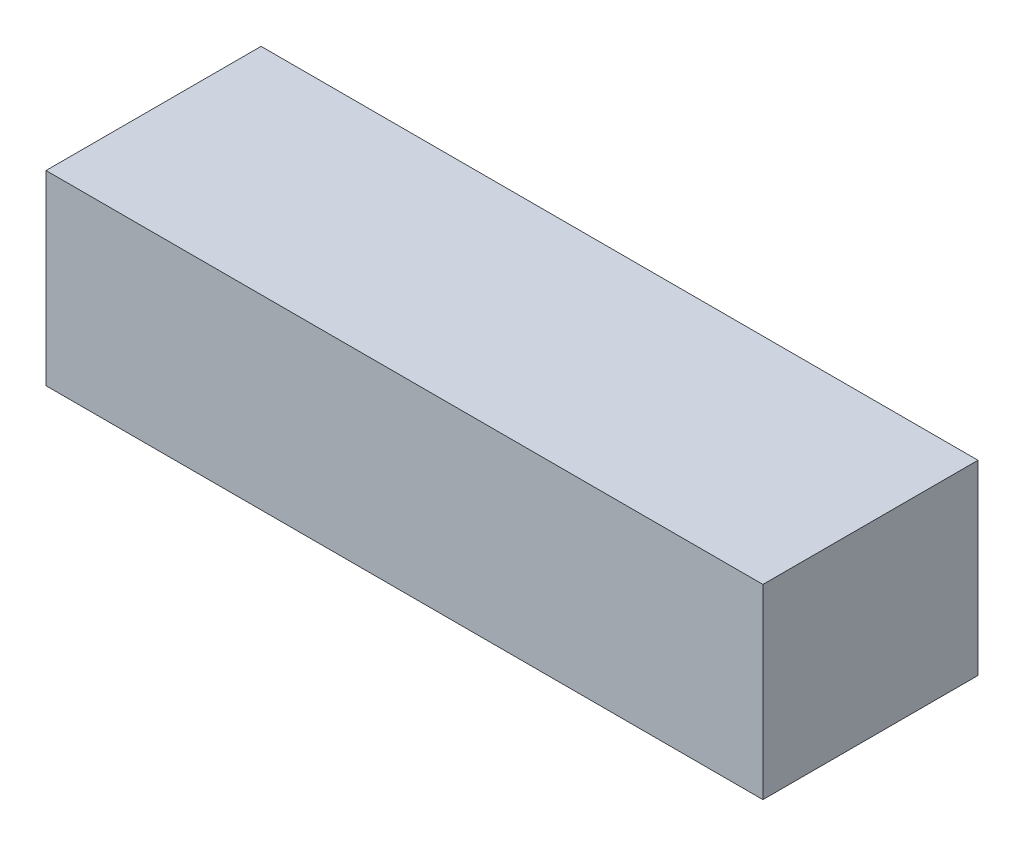
ISO-10303-21;
HEADER;
FILE_DESCRIPTION(('STEP AP214'),'2;1');
FILE_NAME('part.step','',(''),(''),'','','');
FILE_SCHEMA(('AUTOMOTIVE_DESIGN { 1 0 10303 214 1 1 1 1 }'));
ENDSEC;
DATA;
#1=APPLICATION_CONTEXT('core data for automotive mechanical design processes');
#2=APPLICATION_PROTOCOL_DEFINITION('international standard','automotive_design',2000,#1);
#3=PRODUCT_CONTEXT('',#1,'mechanical');
#4=PRODUCT('Part','Part','',(#3));
#5=PRODUCT_RELATED_PRODUCT_CATEGORY('part','',(#4));
#6=PRODUCT_DEFINITION_FORMATION('','',#4);
#7=PRODUCT_DEFINITION_CONTEXT('part definition',#1,'design');
#8=PRODUCT_DEFINITION('design','',#6,#7);
#9=PRODUCT_DEFINITION_SHAPE('','',#8);
#10=(LENGTH_UNIT() NAMED_UNIT(*) SI_UNIT(.MILLI.,.METRE.));
#11=(NAMED_UNIT(*) PLANE_ANGLE_UNIT() SI_UNIT($,.RADIAN.));
#12=(NAMED_UNIT(*) SI_UNIT($,.STERADIAN.) SOLID_ANGLE_UNIT());
#13=UNCERTAINTY_MEASURE_WITH_UNIT(LENGTH_MEASURE(1.E-05),#10,'distance_accuracy_value','');
#14=(GEOMETRIC_REPRESENTATION_CONTEXT(3) GLOBAL_UNCERTAINTY_ASSIGNED_CONTEXT((#13)) GLOBAL_UNIT_ASSIGNED_CONTEXT((#10,
#11,#12)) REPRESENTATION_CONTEXT('',''));
#15=CARTESIAN_POINT('',(0.,0.,0.));
#16=DIRECTION('',(0.,0.,1.));
#17=DIRECTION('',(1.,0.,0.));
#18=AXIS2_PLACEMENT_3D('',#15,#16,#17);
#19=CARTESIAN_POINT('',(-250.,130.,75.));
#20=DIRECTION('',(1.,0.,0.));
#21=DIRECTION('',(0.,0.,-1.));
#22=AXIS2_PLACEMENT_3D('',#19,#20,#21);
#23=PLANE('',#22);
#24=DIRECTION('',(0.,0.,1.));
#25=VECTOR('',#24,1.);
#26=CARTESIAN_POINT('',(-250.,0.,75.));
#27=LINE('',#26,#25);
#28=CARTESIAN_POINT('',(-250.,0.,-75.));
#29=VERTEX_POINT('',#28);
#30=CARTESIAN_POINT('',(-250.,0.,75.));
#31=VERTEX_POINT('',#30);
#32=EDGE_CURVE('E111',#29,#31,#27,.T.);
#33=ORIENTED_EDGE('',*,*,#32,.T.);
#34=DIRECTION('',(0.,-1.,0.));
#35=VECTOR('',#34,1.);
#36=CARTESIAN_POINT('',(-250.,130.,75.));
#37=LINE('',#36,#35);
#38=CARTESIAN_POINT('',(-250.,130.,75.));
#39=VERTEX_POINT('',#38);
#40=EDGE_CURVE('E11',#39,#31,#37,.T.);
#41=ORIENTED_EDGE('',*,*,#40,.F.);
#42=DIRECTION('',(0.,0.,1.));
#43=VECTOR('',#42,1.);
#44=CARTESIAN_POINT('',(-250.,130.,75.));
#45=LINE('',#44,#43);
#46=CARTESIAN_POINT('',(-250.,130.,-75.));
#47=VERTEX_POINT('',#46);
#48=EDGE_CURVE('E95',#47,#39,#45,.T.);
#49=ORIENTED_EDGE('',*,*,#48,.F.);
#50=DIRECTION('',(0.,-1.,0.));
#51=VECTOR('',#50,1.);
#52=CARTESIAN_POINT('',(-250.,130.,-75.));
#53=LINE('',#52,#51);
#54=EDGE_CURVE('E107',#47,#29,#53,.T.);
#55=ORIENTED_EDGE('',*,*,#54,.T.);
#56=EDGE_LOOP('',(#33,#41,#49,#55));
#57=FACE_BOUND('',#56,.T.);
#58=ADVANCED_FACE('F43',(#57),#23,.F.);
#59=CARTESIAN_POINT('',(250.,130.,75.));
#60=DIRECTION('',(0.,0.,-1.));
#61=DIRECTION('',(-1.,0.,0.));
#62=AXIS2_PLACEMENT_3D('',#59,#60,#61);
#63=PLANE('',#62);
#64=DIRECTION('',(1.,0.,0.));
#65=VECTOR('',#64,1.);
#66=CARTESIAN_POINT('',(250.,0.,75.));
#67=LINE('',#66,#65);
#68=CARTESIAN_POINT('',(250.,0.,75.));
#69=VERTEX_POINT('',#68);
#70=EDGE_CURVE('E100',#31,#69,#67,.T.);
#71=ORIENTED_EDGE('',*,*,#70,.T.);
#72=DIRECTION('',(0.,-1.,0.));
#73=VECTOR('',#72,1.);
#74=CARTESIAN_POINT('',(250.,130.,75.));
#75=LINE('',#74,#73);
#76=CARTESIAN_POINT('',(250.,130.,75.));
#77=VERTEX_POINT('',#76);
#78=EDGE_CURVE('E52',#77,#69,#75,.T.);
#79=ORIENTED_EDGE('',*,*,#78,.F.);
#80=DIRECTION('',(1.,0.,0.));
#81=VECTOR('',#80,1.);
#82=CARTESIAN_POINT('',(250.,130.,75.));
#83=LINE('',#82,#81);
#84=EDGE_CURVE('E90',#39,#77,#83,.T.);
#85=ORIENTED_EDGE('',*,*,#84,.F.);
#86=ORIENTED_EDGE('',*,*,#40,.T.);
#87=EDGE_LOOP('',(#71,#79,#85,#86));
#88=FACE_BOUND('',#87,.T.);
#89=ADVANCED_FACE('F99',(#88),#63,.F.);
#90=CARTESIAN_POINT('',(250.,130.,75.));
#91=DIRECTION('',(-1.,0.,0.));
#92=DIRECTION('',(0.,0.,1.));
#93=AXIS2_PLACEMENT_3D('',#90,#91,#92);
#94=PLANE('',#93);
#95=DIRECTION('',(0.,0.,-1.));
#96=VECTOR('',#95,1.);
#97=CARTESIAN_POINT('',(250.,0.,75.));
#98=LINE('',#97,#96);
#99=CARTESIAN_POINT('',(250.,0.,-75.));
#100=VERTEX_POINT('',#99);
#101=EDGE_CURVE('E77',#69,#100,#98,.T.);
#102=ORIENTED_EDGE('',*,*,#101,.T.);
#103=DIRECTION('',(0.,-1.,0.));
#104=VECTOR('',#103,1.);
#105=CARTESIAN_POINT('',(250.,130.,-75.));
#106=LINE('',#105,#104);
#107=CARTESIAN_POINT('',(250.,130.,-75.));
#108=VERTEX_POINT('',#107);
#109=EDGE_CURVE('E102',#108,#100,#106,.T.);
#110=ORIENTED_EDGE('',*,*,#109,.F.);
#111=DIRECTION('',(0.,0.,-1.));
#112=VECTOR('',#111,1.);
#113=CARTESIAN_POINT('',(250.,130.,75.));
#114=LINE('',#113,#112);
#115=EDGE_CURVE('E93',#77,#108,#114,.T.);
#116=ORIENTED_EDGE('',*,*,#115,.F.);
#117=ORIENTED_EDGE('',*,*,#78,.T.);
#118=EDGE_LOOP('',(#102,#110,#116,#117));
#119=FACE_BOUND('',#118,.T.);
#120=ADVANCED_FACE('F103',(#119),#94,.F.);
#121=CARTESIAN_POINT('',(250.,130.,-75.));
#122=DIRECTION('',(0.,0.,1.));
#123=DIRECTION('',(1.,0.,0.));
#124=AXIS2_PLACEMENT_3D('',#121,#122,#123);
#125=PLANE('',#124);
#126=DIRECTION('',(-1.,0.,0.));
#127=VECTOR('',#126,1.);
#128=CARTESIAN_POINT('',(250.,0.,-75.));
#129=LINE('',#128,#127);
#130=EDGE_CURVE('E83',#100,#29,#129,.T.);
#131=ORIENTED_EDGE('',*,*,#130,.T.);
#132=ORIENTED_EDGE('',*,*,#54,.F.);
#133=DIRECTION('',(-1.,0.,0.));
#134=VECTOR('',#133,1.);
#135=CARTESIAN_POINT('',(250.,130.,-75.));
#136=LINE('',#135,#134);
#137=EDGE_CURVE('E60',#108,#47,#136,.T.);
#138=ORIENTED_EDGE('',*,*,#137,.F.);
#139=ORIENTED_EDGE('',*,*,#109,.T.);
#140=EDGE_LOOP('',(#131,#132,#138,#139));
#141=FACE_BOUND('',#140,.T.);
#142=ADVANCED_FACE('F124',(#141),#125,.F.);
#143=CARTESIAN_POINT('',(0.,130.,0.));
#144=DIRECTION('',(0.,1.,0.));
#145=DIRECTION('',(0.,0.,1.));
#146=AXIS2_PLACEMENT_3D('',#143,#144,#145);
#147=PLANE('',#146);
#148=ORIENTED_EDGE('',*,*,#48,.T.);
#149=ORIENTED_EDGE('',*,*,#84,.T.);
#150=ORIENTED_EDGE('',*,*,#115,.T.);
#151=ORIENTED_EDGE('',*,*,#137,.T.);
#152=EDGE_LOOP('',(#148,#149,#150,#151));
#153=FACE_BOUND('',#152,.T.);
#154=ADVANCED_FACE('F91',(#153),#147,.T.);
#155=CARTESIAN_POINT('',(0.,0.,0.));
#156=DIRECTION('',(0.,1.,0.));
#157=DIRECTION('',(0.,0.,1.));
#158=AXIS2_PLACEMENT_3D('',#155,#156,#157);
#159=PLANE('',#158);
#160=ORIENTED_EDGE('',*,*,#32,.F.);
#161=ORIENTED_EDGE('',*,*,#130,.F.);
#162=ORIENTED_EDGE('',*,*,#101,.F.);
#163=ORIENTED_EDGE('',*,*,#70,.F.);
#164=EDGE_LOOP('',(#160,#161,#162,#163));
#165=FACE_BOUND('',#164,.T.);
#166=ADVANCED_FACE('F127',(#165),#159,.F.);
#167=CLOSED_SHELL('',(#58,#89,#120,#142,#154,#166));
#168=MANIFOLD_SOLID_BREP('B2',#167);
#169=ADVANCED_BREP_SHAPE_REPRESENTATION('',(#18,#168),#14);
#170=SHAPE_DEFINITION_REPRESENTATION(#9,#169);
ENDSEC;
END-ISO-10303-21;
